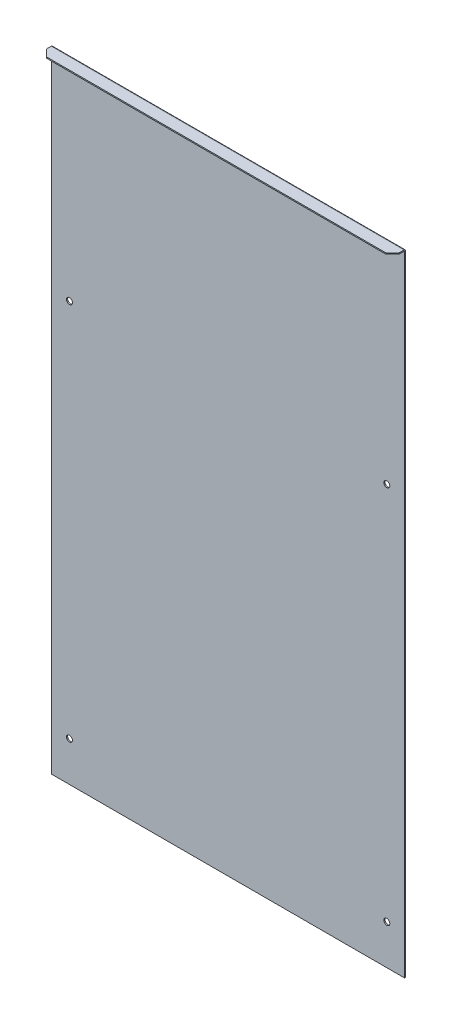
ISO-10303-21;
HEADER;
FILE_DESCRIPTION(('STEP AP214'),'2;1');
FILE_NAME('part.step','',(''),(''),'','','');
FILE_SCHEMA(('AUTOMOTIVE_DESIGN { 1 0 10303 214 1 1 1 1 }'));
ENDSEC;
DATA;
#1=APPLICATION_CONTEXT('core data for automotive mechanical design processes');
#2=APPLICATION_PROTOCOL_DEFINITION('international standard','automotive_design',2000,#1);
#3=PRODUCT_CONTEXT('',#1,'mechanical');
#4=PRODUCT('Part','Part','',(#3));
#5=PRODUCT_RELATED_PRODUCT_CATEGORY('part','',(#4));
#6=PRODUCT_DEFINITION_FORMATION('','',#4);
#7=PRODUCT_DEFINITION_CONTEXT('part definition',#1,'design');
#8=PRODUCT_DEFINITION('design','',#6,#7);
#9=PRODUCT_DEFINITION_SHAPE('','',#8);
#10=(LENGTH_UNIT() NAMED_UNIT(*) SI_UNIT(.MILLI.,.METRE.));
#11=(NAMED_UNIT(*) PLANE_ANGLE_UNIT() SI_UNIT($,.RADIAN.));
#12=(NAMED_UNIT(*) SI_UNIT($,.STERADIAN.) SOLID_ANGLE_UNIT());
#13=UNCERTAINTY_MEASURE_WITH_UNIT(LENGTH_MEASURE(1.E-05),#10,'distance_accuracy_value','');
#14=(GEOMETRIC_REPRESENTATION_CONTEXT(3) GLOBAL_UNCERTAINTY_ASSIGNED_CONTEXT((#13)) GLOBAL_UNIT_ASSIGNED_CONTEXT((#10,
#11,#12)) REPRESENTATION_CONTEXT('',''));
#15=CARTESIAN_POINT('',(0.,0.,0.));
#16=DIRECTION('',(0.,0.,1.));
#17=DIRECTION('',(1.,0.,0.));
#18=AXIS2_PLACEMENT_3D('',#15,#16,#17);
#19=CARTESIAN_POINT('',(-133.2254237,-475.,-0.889));
#20=DIRECTION('',(0.,-1.,0.));
#21=DIRECTION('',(0.,0.,-1.));
#22=AXIS2_PLACEMENT_3D('',#19,#20,#21);
#23=PLANE('',#22);
#24=DIRECTION('',(1.,0.,0.));
#25=VECTOR('',#24,1.);
#26=CARTESIAN_POINT('',(-133.2254237,-475.,0.));
#27=LINE('',#26,#25);
#28=CARTESIAN_POINT('',(-133.2254237,-475.,0.));
#29=VERTEX_POINT('',#28);
#30=CARTESIAN_POINT('',(133.2254237,-475.,0.));
#31=VERTEX_POINT('',#30);
#32=EDGE_CURVE('E212',#29,#31,#27,.T.);
#33=ORIENTED_EDGE('',*,*,#32,.F.);
#34=DIRECTION('',(0.,0.,1.));
#35=VECTOR('',#34,1.);
#36=CARTESIAN_POINT('',(-133.2254237,-475.,-0.889));
#37=LINE('',#36,#35);
#38=CARTESIAN_POINT('',(-133.2254237,-475.,-0.889));
#39=VERTEX_POINT('',#38);
#40=EDGE_CURVE('E236',#39,#29,#37,.T.);
#41=ORIENTED_EDGE('',*,*,#40,.F.);
#42=DIRECTION('',(1.,0.,0.));
#43=VECTOR('',#42,1.);
#44=CARTESIAN_POINT('',(-133.2254237,-475.,-0.889));
#45=LINE('',#44,#43);
#46=CARTESIAN_POINT('',(133.2254237,-475.,-0.889));
#47=VERTEX_POINT('',#46);
#48=EDGE_CURVE('E215',#39,#47,#45,.T.);
#49=ORIENTED_EDGE('',*,*,#48,.T.);
#50=DIRECTION('',(0.,0.,1.));
#51=VECTOR('',#50,1.);
#52=CARTESIAN_POINT('',(133.2254237,-475.,-0.889));
#53=LINE('',#52,#51);
#54=EDGE_CURVE('E226',#47,#31,#53,.T.);
#55=ORIENTED_EDGE('',*,*,#54,.T.);
#56=EDGE_LOOP('',(#33,#41,#49,#55));
#57=FACE_BOUND('',#56,.T.);
#58=ADVANCED_FACE('F57',(#57),#23,.T.);
#59=CARTESIAN_POINT('',(-133.2254237,-475.,-0.889));
#60=DIRECTION('',(-1.,0.,0.));
#61=DIRECTION('',(0.,0.,1.));
#62=AXIS2_PLACEMENT_3D('',#59,#60,#61);
#63=PLANE('',#62);
#64=DIRECTION('',(0.,-1.,0.));
#65=VECTOR('',#64,1.);
#66=CARTESIAN_POINT('',(-133.2254237,-475.,0.));
#67=LINE('',#66,#65);
#68=CARTESIAN_POINT('',(-133.2254237,0.,0.));
#69=VERTEX_POINT('',#68);
#70=EDGE_CURVE('E219',#69,#29,#67,.T.);
#71=ORIENTED_EDGE('',*,*,#70,.F.);
#72=DIRECTION('',(0.,0.,1.));
#73=VECTOR('',#72,1.);
#74=CARTESIAN_POINT('',(-133.2254237,0.,-0.889));
#75=LINE('',#74,#73);
#76=CARTESIAN_POINT('',(-133.2254237,0.,-0.889000000000009));
#77=VERTEX_POINT('',#76);
#78=EDGE_CURVE('E239',#77,#69,#75,.T.);
#79=ORIENTED_EDGE('',*,*,#78,.F.);
#80=DIRECTION('',(0.,-1.,0.));
#81=VECTOR('',#80,1.);
#82=CARTESIAN_POINT('',(-133.2254237,-475.,-0.889));
#83=LINE('',#82,#81);
#84=EDGE_CURVE('E223',#77,#39,#83,.T.);
#85=ORIENTED_EDGE('',*,*,#84,.T.);
#86=ORIENTED_EDGE('',*,*,#40,.T.);
#87=EDGE_LOOP('',(#71,#79,#85,#86));
#88=FACE_BOUND('',#87,.T.);
#89=ADVANCED_FACE('F283',(#88),#63,.T.);
#90=CARTESIAN_POINT('',(133.2254237,-475.,-0.889));
#91=DIRECTION('',(1.,0.,0.));
#92=DIRECTION('',(0.,0.,-1.));
#93=AXIS2_PLACEMENT_3D('',#90,#91,#92);
#94=PLANE('',#93);
#95=DIRECTION('',(0.,1.,0.));
#96=VECTOR('',#95,1.);
#97=CARTESIAN_POINT('',(133.2254237,-475.,0.));
#98=LINE('',#97,#96);
#99=CARTESIAN_POINT('',(133.2254237,0.,0.));
#100=VERTEX_POINT('',#99);
#101=EDGE_CURVE('E229',#31,#100,#98,.T.);
#102=ORIENTED_EDGE('',*,*,#101,.F.);
#103=ORIENTED_EDGE('',*,*,#54,.F.);
#104=DIRECTION('',(0.,1.,0.));
#105=VECTOR('',#104,1.);
#106=CARTESIAN_POINT('',(133.2254237,-475.,-0.889));
#107=LINE('',#106,#105);
#108=CARTESIAN_POINT('',(133.2254237,0.,-0.889));
#109=VERTEX_POINT('',#108);
#110=EDGE_CURVE('E218',#47,#109,#107,.T.);
#111=ORIENTED_EDGE('',*,*,#110,.T.);
#112=DIRECTION('',(0.,0.,1.));
#113=VECTOR('',#112,1.);
#114=CARTESIAN_POINT('',(133.2254237,0.,-0.889));
#115=LINE('',#114,#113);
#116=EDGE_CURVE('E241',#109,#100,#115,.T.);
#117=ORIENTED_EDGE('',*,*,#116,.T.);
#118=EDGE_LOOP('',(#102,#103,#111,#117));
#119=FACE_BOUND('',#118,.T.);
#120=ADVANCED_FACE('F271',(#119),#94,.T.);
#121=CARTESIAN_POINT('',(0.,0.,-0.889));
#122=DIRECTION('',(0.,0.,1.));
#123=DIRECTION('',(1.,0.,0.));
#124=AXIS2_PLACEMENT_3D('',#121,#122,#123);
#125=PLANE('',#124);
#126=CARTESIAN_POINT('',(-119.8215307,-445.,-0.889));
#127=DIRECTION('',(0.,0.,-1.));
#128=DIRECTION('',(-1.,0.,0.));
#129=AXIS2_PLACEMENT_3D('',#126,#127,#128);
#130=CIRCLE('',#129,2.24999999999998);
#131=CARTESIAN_POINT('',(-122.0715307,-445.,-0.889));
#132=VERTEX_POINT('',#131);
#133=EDGE_CURVE('E186',#132,#132,#130,.T.);
#134=ORIENTED_EDGE('',*,*,#133,.F.);
#135=EDGE_LOOP('',(#134));
#136=FACE_BOUND('',#135,.T.);
#137=CARTESIAN_POINT('',(119.8215307,-445.,-0.889));
#138=DIRECTION('',(0.,0.,-1.));
#139=DIRECTION('',(-1.,0.,0.));
#140=AXIS2_PLACEMENT_3D('',#137,#138,#139);
#141=CIRCLE('',#140,2.25);
#142=CARTESIAN_POINT('',(117.5715307,-445.,-0.889));
#143=VERTEX_POINT('',#142);
#144=EDGE_CURVE('E194',#143,#143,#141,.T.);
#145=ORIENTED_EDGE('',*,*,#144,.F.);
#146=EDGE_LOOP('',(#145));
#147=FACE_BOUND('',#146,.T.);
#148=CARTESIAN_POINT('',(-119.8215307,-158.867160024,-0.889));
#149=DIRECTION('',(0.,0.,-1.));
#150=DIRECTION('',(-1.,0.,0.));
#151=AXIS2_PLACEMENT_3D('',#148,#149,#150);
#152=CIRCLE('',#151,2.24999999999998);
#153=CARTESIAN_POINT('',(-122.0715307,-158.867160024,-0.889));
#154=VERTEX_POINT('',#153);
#155=EDGE_CURVE('E200',#154,#154,#152,.T.);
#156=ORIENTED_EDGE('',*,*,#155,.F.);
#157=EDGE_LOOP('',(#156));
#158=FACE_BOUND('',#157,.T.);
#159=CARTESIAN_POINT('',(119.8215307,-158.867160024,-0.889));
#160=DIRECTION('',(0.,0.,-1.));
#161=DIRECTION('',(-1.,0.,0.));
#162=AXIS2_PLACEMENT_3D('',#159,#160,#161);
#163=CIRCLE('',#162,2.25);
#164=CARTESIAN_POINT('',(117.5715307,-158.867160024,-0.889));
#165=VERTEX_POINT('',#164);
#166=EDGE_CURVE('E206',#165,#165,#163,.T.);
#167=ORIENTED_EDGE('',*,*,#166,.F.);
#168=EDGE_LOOP('',(#167));
#169=FACE_BOUND('',#168,.T.);
#170=ORIENTED_EDGE('',*,*,#48,.F.);
#171=ORIENTED_EDGE('',*,*,#84,.F.);
#172=DIRECTION('',(-1.,0.,0.));
#173=VECTOR('',#172,1.);
#174=CARTESIAN_POINT('',(-133.2254237,0.,-0.889));
#175=LINE('',#174,#173);
#176=EDGE_CURVE('E142',#109,#77,#175,.T.);
#177=ORIENTED_EDGE('',*,*,#176,.F.);
#178=ORIENTED_EDGE('',*,*,#110,.F.);
#179=EDGE_LOOP('',(#170,#171,#177,#178));
#180=FACE_BOUND('',#179,.T.);
#181=ADVANCED_FACE('F280',(#136,#147,#158,#169,#180),#125,.F.);
#182=CARTESIAN_POINT('',(0.,0.,0.));
#183=DIRECTION('',(0.,0.,1.));
#184=DIRECTION('',(1.,0.,0.));
#185=AXIS2_PLACEMENT_3D('',#182,#183,#184);
#186=PLANE('',#185);
#187=CARTESIAN_POINT('',(-119.8215307,-445.,0.));
#188=DIRECTION('',(0.,0.,-1.));
#189=DIRECTION('',(-1.,0.,0.));
#190=AXIS2_PLACEMENT_3D('',#187,#188,#189);
#191=CIRCLE('',#190,2.24999999999998);
#192=CARTESIAN_POINT('',(-122.0715307,-445.,0.));
#193=VERTEX_POINT('',#192);
#194=EDGE_CURVE('E191',#193,#193,#191,.T.);
#195=ORIENTED_EDGE('',*,*,#194,.T.);
#196=EDGE_LOOP('',(#195));
#197=FACE_BOUND('',#196,.T.);
#198=CARTESIAN_POINT('',(119.8215307,-445.,0.));
#199=DIRECTION('',(0.,0.,-1.));
#200=DIRECTION('',(-1.,0.,0.));
#201=AXIS2_PLACEMENT_3D('',#198,#199,#200);
#202=CIRCLE('',#201,2.25);
#203=CARTESIAN_POINT('',(117.5715307,-445.,0.));
#204=VERTEX_POINT('',#203);
#205=EDGE_CURVE('E197',#204,#204,#202,.T.);
#206=ORIENTED_EDGE('',*,*,#205,.T.);
#207=EDGE_LOOP('',(#206));
#208=FACE_BOUND('',#207,.T.);
#209=CARTESIAN_POINT('',(-119.8215307,-158.867160024,0.));
#210=DIRECTION('',(0.,0.,-1.));
#211=DIRECTION('',(-1.,0.,0.));
#212=AXIS2_PLACEMENT_3D('',#209,#210,#211);
#213=CIRCLE('',#212,2.24999999999998);
#214=CARTESIAN_POINT('',(-122.0715307,-158.867160024,0.));
#215=VERTEX_POINT('',#214);
#216=EDGE_CURVE('E203',#215,#215,#213,.T.);
#217=ORIENTED_EDGE('',*,*,#216,.T.);
#218=EDGE_LOOP('',(#217));
#219=FACE_BOUND('',#218,.T.);
#220=CARTESIAN_POINT('',(119.8215307,-158.867160024,0.));
#221=DIRECTION('',(0.,0.,-1.));
#222=DIRECTION('',(-1.,0.,0.));
#223=AXIS2_PLACEMENT_3D('',#220,#221,#222);
#224=CIRCLE('',#223,2.25);
#225=CARTESIAN_POINT('',(117.5715307,-158.867160024,0.));
#226=VERTEX_POINT('',#225);
#227=EDGE_CURVE('E209',#226,#226,#224,.T.);
#228=ORIENTED_EDGE('',*,*,#227,.T.);
#229=EDGE_LOOP('',(#228));
#230=FACE_BOUND('',#229,.T.);
#231=ORIENTED_EDGE('',*,*,#32,.T.);
#232=ORIENTED_EDGE('',*,*,#101,.T.);
#233=DIRECTION('',(-1.,0.,0.));
#234=VECTOR('',#233,1.);
#235=CARTESIAN_POINT('',(-133.2254237,0.,0.));
#236=LINE('',#235,#234);
#237=EDGE_CURVE('E232',#100,#69,#236,.T.);
#238=ORIENTED_EDGE('',*,*,#237,.T.);
#239=ORIENTED_EDGE('',*,*,#70,.T.);
#240=EDGE_LOOP('',(#231,#232,#238,#239));
#241=FACE_BOUND('',#240,.T.);
#242=ADVANCED_FACE('F274',(#197,#208,#219,#230,#241),#186,.T.);
#243=CARTESIAN_POINT('',(119.8215307,-158.867160024,0.));
#244=DIRECTION('',(0.,0.,-1.));
#245=DIRECTION('',(-1.,0.,0.));
#246=AXIS2_PLACEMENT_3D('',#243,#244,#245);
#247=CYLINDRICAL_SURFACE('',#246,2.25);
#248=ORIENTED_EDGE('',*,*,#227,.F.);
#249=EDGE_LOOP('',(#248));
#250=FACE_BOUND('',#249,.T.);
#251=ORIENTED_EDGE('',*,*,#166,.T.);
#252=EDGE_LOOP('',(#251));
#253=FACE_BOUND('',#252,.T.);
#254=ADVANCED_FACE('F333',(#250,#253),#247,.F.);
#255=CARTESIAN_POINT('',(-119.8215307,-158.867160024,0.));
#256=DIRECTION('',(0.,0.,-1.));
#257=DIRECTION('',(-1.,0.,0.));
#258=AXIS2_PLACEMENT_3D('',#255,#256,#257);
#259=CYLINDRICAL_SURFACE('',#258,2.24999999999998);
#260=ORIENTED_EDGE('',*,*,#216,.F.);
#261=EDGE_LOOP('',(#260));
#262=FACE_BOUND('',#261,.T.);
#263=ORIENTED_EDGE('',*,*,#155,.T.);
#264=EDGE_LOOP('',(#263));
#265=FACE_BOUND('',#264,.T.);
#266=ADVANCED_FACE('F329',(#262,#265),#259,.F.);
#267=CARTESIAN_POINT('',(119.8215307,-445.,0.));
#268=DIRECTION('',(0.,0.,-1.));
#269=DIRECTION('',(-1.,0.,0.));
#270=AXIS2_PLACEMENT_3D('',#267,#268,#269);
#271=CYLINDRICAL_SURFACE('',#270,2.25);
#272=ORIENTED_EDGE('',*,*,#205,.F.);
#273=EDGE_LOOP('',(#272));
#274=FACE_BOUND('',#273,.T.);
#275=ORIENTED_EDGE('',*,*,#144,.T.);
#276=EDGE_LOOP('',(#275));
#277=FACE_BOUND('',#276,.T.);
#278=ADVANCED_FACE('F325',(#274,#277),#271,.F.);
#279=CARTESIAN_POINT('',(-119.8215307,-445.,0.));
#280=DIRECTION('',(0.,0.,-1.));
#281=DIRECTION('',(-1.,0.,0.));
#282=AXIS2_PLACEMENT_3D('',#279,#280,#281);
#283=CYLINDRICAL_SURFACE('',#282,2.24999999999998);
#284=ORIENTED_EDGE('',*,*,#194,.F.);
#285=EDGE_LOOP('',(#284));
#286=FACE_BOUND('',#285,.T.);
#287=ORIENTED_EDGE('',*,*,#133,.T.);
#288=EDGE_LOOP('',(#287));
#289=FACE_BOUND('',#288,.T.);
#290=ADVANCED_FACE('F320',(#286,#289),#283,.F.);
#291=CARTESIAN_POINT('',(133.2254237,0.,0.381));
#292=DIRECTION('',(1.,0.,0.));
#293=DIRECTION('',(0.,1.,0.));
#294=AXIS2_PLACEMENT_3D('',#291,#292,#293);
#295=PLANE('',#294);
#296=DIRECTION('',(0.,-1.,0.));
#297=VECTOR('',#296,1.);
#298=CARTESIAN_POINT('',(133.2254237,1.27,0.380999999999996));
#299=LINE('',#298,#297);
#300=CARTESIAN_POINT('',(133.2254237,0.381,0.380999999999999));
#301=VERTEX_POINT('',#300);
#302=CARTESIAN_POINT('',(133.2254237,1.27,0.380999999999996));
#303=VERTEX_POINT('',#302);
#304=EDGE_CURVE('E183',#301,#303,#299,.F.);
#305=ORIENTED_EDGE('',*,*,#304,.F.);
#306=CARTESIAN_POINT('',(133.2254237,0.,0.381));
#307=DIRECTION('',(-1.,0.,0.));
#308=DIRECTION('',(0.,-1.,0.));
#309=AXIS2_PLACEMENT_3D('',#306,#307,#308);
#310=CIRCLE('',#309,0.381000000000009);
#311=EDGE_CURVE('E146',#100,#301,#310,.F.);
#312=ORIENTED_EDGE('',*,*,#311,.F.);
#313=ORIENTED_EDGE('',*,*,#116,.F.);
#314=CARTESIAN_POINT('',(133.2254237,0.,0.381));
#315=DIRECTION('',(-1.,0.,0.));
#316=DIRECTION('',(0.,-1.,0.));
#317=AXIS2_PLACEMENT_3D('',#314,#315,#316);
#318=CIRCLE('',#317,1.27000000000001);
#319=EDGE_CURVE('E145',#109,#303,#318,.F.);
#320=ORIENTED_EDGE('',*,*,#319,.T.);
#321=EDGE_LOOP('',(#305,#312,#313,#320));
#322=FACE_BOUND('',#321,.T.);
#323=ADVANCED_FACE('F268',(#322),#295,.T.);
#324=CARTESIAN_POINT('',(-133.2254237,0.,0.381));
#325=DIRECTION('',(1.,0.,0.));
#326=DIRECTION('',(0.,1.,0.));
#327=AXIS2_PLACEMENT_3D('',#324,#325,#326);
#328=PLANE('',#327);
#329=CARTESIAN_POINT('',(-133.2254237,0.,0.381));
#330=DIRECTION('',(-1.,0.,0.));
#331=DIRECTION('',(0.,-1.,0.));
#332=AXIS2_PLACEMENT_3D('',#329,#330,#331);
#333=CIRCLE('',#332,0.381000000000009);
#334=CARTESIAN_POINT('',(-133.2254237,0.381000000000019,0.380999999999999));
#335=VERTEX_POINT('',#334);
#336=EDGE_CURVE('E153',#335,#69,#333,.T.);
#337=ORIENTED_EDGE('',*,*,#336,.F.);
#338=DIRECTION('',(0.,-1.,0.));
#339=VECTOR('',#338,1.);
#340=CARTESIAN_POINT('',(-133.2254237,0.381,0.380999999999999));
#341=LINE('',#340,#339);
#342=CARTESIAN_POINT('',(-133.2254237,1.27,0.380999999999996));
#343=VERTEX_POINT('',#342);
#344=EDGE_CURVE('E150',#335,#343,#341,.F.);
#345=ORIENTED_EDGE('',*,*,#344,.T.);
#346=CARTESIAN_POINT('',(-133.2254237,0.,0.381));
#347=DIRECTION('',(-1.,0.,0.));
#348=DIRECTION('',(0.,-1.,0.));
#349=AXIS2_PLACEMENT_3D('',#346,#347,#348);
#350=CIRCLE('',#349,1.27000000000001);
#351=EDGE_CURVE('E135',#343,#77,#350,.T.);
#352=ORIENTED_EDGE('',*,*,#351,.T.);
#353=ORIENTED_EDGE('',*,*,#78,.T.);
#354=EDGE_LOOP('',(#337,#345,#352,#353));
#355=FACE_BOUND('',#354,.T.);
#356=ADVANCED_FACE('F151',(#355),#328,.F.);
#357=CARTESIAN_POINT('',(-133.2254237,0.,0.381));
#358=DIRECTION('',(-1.,0.,0.));
#359=DIRECTION('',(0.,1.,0.));
#360=AXIS2_PLACEMENT_3D('',#357,#358,#359);
#361=CYLINDRICAL_SURFACE('',#360,1.27000000000001);
#362=ORIENTED_EDGE('',*,*,#176,.T.);
#363=ORIENTED_EDGE('',*,*,#351,.F.);
#364=DIRECTION('',(-1.,0.,0.));
#365=VECTOR('',#364,1.);
#366=CARTESIAN_POINT('',(133.2254237,1.27,0.380999999999996));
#367=LINE('',#366,#365);
#368=EDGE_CURVE('E140',#343,#303,#367,.F.);
#369=ORIENTED_EDGE('',*,*,#368,.T.);
#370=ORIENTED_EDGE('',*,*,#319,.F.);
#371=EDGE_LOOP('',(#362,#363,#369,#370));
#372=FACE_BOUND('',#371,.T.);
#373=ADVANCED_FACE('F137',(#372),#361,.T.);
#374=CARTESIAN_POINT('',(-133.2254237,0.,0.381));
#375=DIRECTION('',(-1.,0.,0.));
#376=DIRECTION('',(0.,1.,0.));
#377=AXIS2_PLACEMENT_3D('',#374,#375,#376);
#378=CYLINDRICAL_SURFACE('',#377,0.381000000000009);
#379=ORIENTED_EDGE('',*,*,#237,.F.);
#380=ORIENTED_EDGE('',*,*,#311,.T.);
#381=DIRECTION('',(-1.,0.,0.));
#382=VECTOR('',#381,1.);
#383=CARTESIAN_POINT('',(133.2254237,0.381,0.380999999999999));
#384=LINE('',#383,#382);
#385=EDGE_CURVE('E158',#301,#335,#384,.T.);
#386=ORIENTED_EDGE('',*,*,#385,.T.);
#387=ORIENTED_EDGE('',*,*,#336,.T.);
#388=EDGE_LOOP('',(#379,#380,#386,#387));
#389=FACE_BOUND('',#388,.T.);
#390=ADVANCED_FACE('F264',(#389),#378,.F.);
#391=CARTESIAN_POINT('',(133.2254237,1.27,0.));
#392=DIRECTION('',(-1.,0.,0.));
#393=DIRECTION('',(0.,0.,1.));
#394=AXIS2_PLACEMENT_3D('',#391,#392,#393);
#395=PLANE('',#394);
#396=DIRECTION('',(0.,0.,-1.));
#397=VECTOR('',#396,1.);
#398=CARTESIAN_POINT('',(133.2254237,1.27,0.));
#399=LINE('',#398,#397);
#400=CARTESIAN_POINT('',(133.2254237,1.27000000000001,4.111));
#401=VERTEX_POINT('',#400);
#402=EDGE_CURVE('E166',#401,#303,#399,.T.);
#403=ORIENTED_EDGE('',*,*,#402,.F.);
#404=DIRECTION('',(0.,-1.,0.));
#405=VECTOR('',#404,1.);
#406=CARTESIAN_POINT('',(133.2254237,1.27000000000001,4.111));
#407=LINE('',#406,#405);
#408=CARTESIAN_POINT('',(133.2254237,0.381000000000013,4.111));
#409=VERTEX_POINT('',#408);
#410=EDGE_CURVE('E251',#401,#409,#407,.T.);
#411=ORIENTED_EDGE('',*,*,#410,.T.);
#412=DIRECTION('',(0.,0.,1.));
#413=VECTOR('',#412,1.);
#414=CARTESIAN_POINT('',(133.2254237,0.380999999999999,0.));
#415=LINE('',#414,#413);
#416=EDGE_CURVE('E167',#409,#301,#415,.F.);
#417=ORIENTED_EDGE('',*,*,#416,.T.);
#418=ORIENTED_EDGE('',*,*,#304,.T.);
#419=EDGE_LOOP('',(#403,#411,#417,#418));
#420=FACE_BOUND('',#419,.T.);
#421=ADVANCED_FACE('F256',(#420),#395,.F.);
#422=CARTESIAN_POINT('',(-133.2254237,1.27000000000003,9.111));
#423=DIRECTION('',(1.,0.,0.));
#424=DIRECTION('',(0.,0.,-1.));
#425=AXIS2_PLACEMENT_3D('',#422,#423,#424);
#426=PLANE('',#425);
#427=DIRECTION('',(0.,0.,-1.));
#428=VECTOR('',#427,1.);
#429=CARTESIAN_POINT('',(-133.2254237,0.38100000000003,9.111));
#430=LINE('',#429,#428);
#431=CARTESIAN_POINT('',(-133.2254237,0.381000000000013,4.111));
#432=VERTEX_POINT('',#431);
#433=EDGE_CURVE('E179',#335,#432,#430,.F.);
#434=ORIENTED_EDGE('',*,*,#433,.T.);
#435=DIRECTION('',(0.,1.,0.));
#436=VECTOR('',#435,1.);
#437=CARTESIAN_POINT('',(-133.2254237,1.27000000000001,4.111));
#438=LINE('',#437,#436);
#439=CARTESIAN_POINT('',(-133.2254237,1.27000000000001,4.111));
#440=VERTEX_POINT('',#439);
#441=EDGE_CURVE('E171',#432,#440,#438,.T.);
#442=ORIENTED_EDGE('',*,*,#441,.T.);
#443=DIRECTION('',(0.,0.,1.));
#444=VECTOR('',#443,1.);
#445=CARTESIAN_POINT('',(-133.2254237,1.27,0.));
#446=LINE('',#445,#444);
#447=EDGE_CURVE('E163',#343,#440,#446,.T.);
#448=ORIENTED_EDGE('',*,*,#447,.F.);
#449=ORIENTED_EDGE('',*,*,#344,.F.);
#450=EDGE_LOOP('',(#434,#442,#448,#449));
#451=FACE_BOUND('',#450,.T.);
#452=ADVANCED_FACE('F169',(#451),#426,.F.);
#453=CARTESIAN_POINT('',(0.,1.27,0.));
#454=DIRECTION('',(0.,-1.,0.));
#455=DIRECTION('',(0.,0.,-1.));
#456=AXIS2_PLACEMENT_3D('',#453,#454,#455);
#457=PLANE('',#456);
#458=DIRECTION('',(1.,0.,0.));
#459=VECTOR('',#458,1.);
#460=CARTESIAN_POINT('',(0.,1.27000000000003,9.111));
#461=LINE('',#460,#459);
#462=CARTESIAN_POINT('',(-128.2254237,1.27000000000003,9.111));
#463=VERTEX_POINT('',#462);
#464=CARTESIAN_POINT('',(128.2254237,1.27000000000003,9.111));
#465=VERTEX_POINT('',#464);
#466=EDGE_CURVE('E172',#463,#465,#461,.T.);
#467=ORIENTED_EDGE('',*,*,#466,.T.);
#468=DIRECTION('',(-0.707106781186548,0.,0.707106781186547));
#469=VECTOR('',#468,1.);
#470=CARTESIAN_POINT('',(133.2254237,1.27000000000001,4.111));
#471=LINE('',#470,#469);
#472=EDGE_CURVE('E13',#465,#401,#471,.F.);
#473=ORIENTED_EDGE('',*,*,#472,.T.);
#474=ORIENTED_EDGE('',*,*,#402,.T.);
#475=ORIENTED_EDGE('',*,*,#368,.F.);
#476=ORIENTED_EDGE('',*,*,#447,.T.);
#477=DIRECTION('',(-0.707106781186548,0.,-0.707106781186547));
#478=VECTOR('',#477,1.);
#479=CARTESIAN_POINT('',(-128.2254237,1.27000000000003,9.111));
#480=LINE('',#479,#478);
#481=EDGE_CURVE('E249',#440,#463,#480,.F.);
#482=ORIENTED_EDGE('',*,*,#481,.T.);
#483=EDGE_LOOP('',(#467,#473,#474,#475,#476,#482));
#484=FACE_BOUND('',#483,.T.);
#485=ADVANCED_FACE('F162',(#484),#457,.F.);
#486=CARTESIAN_POINT('',(0.,0.380999999999999,0.));
#487=DIRECTION('',(0.,-1.,0.));
#488=DIRECTION('',(0.,0.,-1.));
#489=AXIS2_PLACEMENT_3D('',#486,#487,#488);
#490=PLANE('',#489);
#491=ORIENTED_EDGE('',*,*,#416,.F.);
#492=DIRECTION('',(0.707106781186548,0.,-0.707106781186547));
#493=VECTOR('',#492,1.);
#494=CARTESIAN_POINT('',(68.6682118499999,0.381000000000238,68.66821185));
#495=LINE('',#494,#493);
#496=CARTESIAN_POINT('',(128.2254237,0.38100000000003,9.111));
#497=VERTEX_POINT('',#496);
#498=EDGE_CURVE('E79',#409,#497,#495,.F.);
#499=ORIENTED_EDGE('',*,*,#498,.T.);
#500=DIRECTION('',(-1.,0.,0.));
#501=VECTOR('',#500,1.);
#502=CARTESIAN_POINT('',(133.2254237,0.38100000000003,9.111));
#503=LINE('',#502,#501);
#504=CARTESIAN_POINT('',(-128.2254237,0.38100000000003,9.111));
#505=VERTEX_POINT('',#504);
#506=EDGE_CURVE('E175',#505,#497,#503,.F.);
#507=ORIENTED_EDGE('',*,*,#506,.F.);
#508=DIRECTION('',(0.707106781186548,0.,0.707106781186547));
#509=VECTOR('',#508,1.);
#510=CARTESIAN_POINT('',(-68.6682118499999,0.381000000000238,68.66821185));
#511=LINE('',#510,#509);
#512=EDGE_CURVE('E246',#505,#432,#511,.F.);
#513=ORIENTED_EDGE('',*,*,#512,.T.);
#514=ORIENTED_EDGE('',*,*,#433,.F.);
#515=ORIENTED_EDGE('',*,*,#385,.F.);
#516=EDGE_LOOP('',(#491,#499,#507,#513,#514,#515));
#517=FACE_BOUND('',#516,.T.);
#518=ADVANCED_FACE('F261',(#517),#490,.T.);
#519=CARTESIAN_POINT('',(133.2254237,1.27000000000003,9.111));
#520=DIRECTION('',(0.,0.,-1.));
#521=DIRECTION('',(0.,1.,0.));
#522=AXIS2_PLACEMENT_3D('',#519,#520,#521);
#523=PLANE('',#522);
#524=ORIENTED_EDGE('',*,*,#506,.T.);
#525=DIRECTION('',(0.,1.,0.));
#526=VECTOR('',#525,1.);
#527=CARTESIAN_POINT('',(128.2254237,1.27000000000003,9.111));
#528=LINE('',#527,#526);
#529=EDGE_CURVE('E65',#497,#465,#528,.T.);
#530=ORIENTED_EDGE('',*,*,#529,.T.);
#531=ORIENTED_EDGE('',*,*,#466,.F.);
#532=DIRECTION('',(0.,-1.,0.));
#533=VECTOR('',#532,1.);
#534=CARTESIAN_POINT('',(-128.2254237,1.27000000000003,9.111));
#535=LINE('',#534,#533);
#536=EDGE_CURVE('E238',#463,#505,#535,.T.);
#537=ORIENTED_EDGE('',*,*,#536,.T.);
#538=EDGE_LOOP('',(#524,#530,#531,#537));
#539=FACE_BOUND('',#538,.T.);
#540=ADVANCED_FACE('F296',(#539),#523,.F.);
#541=CARTESIAN_POINT('',(-128.2254237,1.27000000000003,9.111));
#542=DIRECTION('',(0.707106781186547,0.,-0.707106781186548));
#543=DIRECTION('',(0.,-1.,0.));
#544=AXIS2_PLACEMENT_3D('',#541,#542,#543);
#545=PLANE('',#544);
#546=ORIENTED_EDGE('',*,*,#481,.F.);
#547=ORIENTED_EDGE('',*,*,#441,.F.);
#548=ORIENTED_EDGE('',*,*,#512,.F.);
#549=ORIENTED_EDGE('',*,*,#536,.F.);
#550=EDGE_LOOP('',(#546,#547,#548,#549));
#551=FACE_BOUND('',#550,.T.);
#552=ADVANCED_FACE('F294',(#551),#545,.F.);
#553=CARTESIAN_POINT('',(133.2254237,1.27000000000001,4.111));
#554=DIRECTION('',(-0.707106781186547,0.,-0.707106781186548));
#555=DIRECTION('',(0.,-1.,0.));
#556=AXIS2_PLACEMENT_3D('',#553,#554,#555);
#557=PLANE('',#556);
#558=ORIENTED_EDGE('',*,*,#472,.F.);
#559=ORIENTED_EDGE('',*,*,#529,.F.);
#560=ORIENTED_EDGE('',*,*,#498,.F.);
#561=ORIENTED_EDGE('',*,*,#410,.F.);
#562=EDGE_LOOP('',(#558,#559,#560,#561));
#563=FACE_BOUND('',#562,.T.);
#564=ADVANCED_FACE('F59',(#563),#557,.F.);
#565=CLOSED_SHELL('',(#58,#89,#120,#181,#242,#254,#266,#278,#290,#323,#356,#373,#390,#421,#452,
#485,#518,#540,#552,#564));
#566=MANIFOLD_SOLID_BREP('B2',#565);
#567=ADVANCED_BREP_SHAPE_REPRESENTATION('',(#18,#566),#14);
#568=SHAPE_DEFINITION_REPRESENTATION(#9,#567);
ENDSEC;
END-ISO-10303-21;
